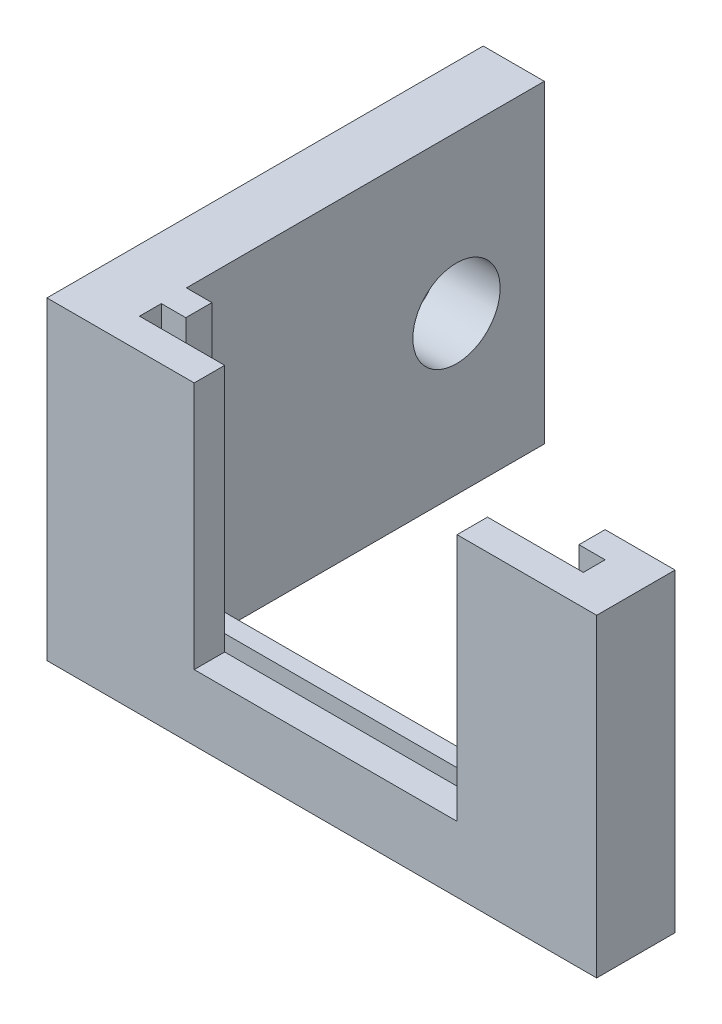
ISO-10303-21;
HEADER;
FILE_DESCRIPTION(('STEP AP214'),'2;1');
FILE_NAME('part.step','',(''),(''),'','','');
FILE_SCHEMA(('AUTOMOTIVE_DESIGN { 1 0 10303 214 1 1 1 1 }'));
ENDSEC;
DATA;
#1=APPLICATION_CONTEXT('core data for automotive mechanical design processes');
#2=APPLICATION_PROTOCOL_DEFINITION('international standard','automotive_design',2000,#1);
#3=PRODUCT_CONTEXT('',#1,'mechanical');
#4=PRODUCT('Part','Part','',(#3));
#5=PRODUCT_RELATED_PRODUCT_CATEGORY('part','',(#4));
#6=PRODUCT_DEFINITION_FORMATION('','',#4);
#7=PRODUCT_DEFINITION_CONTEXT('part definition',#1,'design');
#8=PRODUCT_DEFINITION('design','',#6,#7);
#9=PRODUCT_DEFINITION_SHAPE('','',#8);
#10=(LENGTH_UNIT() NAMED_UNIT(*) SI_UNIT(.MILLI.,.METRE.));
#11=(NAMED_UNIT(*) PLANE_ANGLE_UNIT() SI_UNIT($,.RADIAN.));
#12=(NAMED_UNIT(*) SI_UNIT($,.STERADIAN.) SOLID_ANGLE_UNIT());
#13=UNCERTAINTY_MEASURE_WITH_UNIT(LENGTH_MEASURE(1.E-05),#10,'distance_accuracy_value','');
#14=(GEOMETRIC_REPRESENTATION_CONTEXT(3) GLOBAL_UNCERTAINTY_ASSIGNED_CONTEXT((#13)) GLOBAL_UNIT_ASSIGNED_CONTEXT((#10,
#11,#12)) REPRESENTATION_CONTEXT('',''));
#15=CARTESIAN_POINT('',(0.,0.,0.));
#16=DIRECTION('',(0.,0.,1.));
#17=DIRECTION('',(1.,0.,0.));
#18=AXIS2_PLACEMENT_3D('',#15,#16,#17);
#19=CARTESIAN_POINT('',(0.,18.,25.));
#20=DIRECTION('',(0.,-1.,0.));
#21=DIRECTION('',(0.,0.,-1.));
#22=AXIS2_PLACEMENT_3D('',#19,#20,#21);
#23=PLANE('',#22);
#24=DIRECTION('',(-1.,0.,0.));
#25=VECTOR('',#24,1.);
#26=CARTESIAN_POINT('',(0.,18.,25.));
#27=LINE('',#26,#25);
#28=CARTESIAN_POINT('',(8.43878041398375,18.,25.));
#29=VERTEX_POINT('',#28);
#30=CARTESIAN_POINT('',(0.,18.,25.));
#31=VERTEX_POINT('',#30);
#32=EDGE_CURVE('E201',#29,#31,#27,.T.);
#33=ORIENTED_EDGE('',*,*,#32,.F.);
#34=DIRECTION('',(0.,0.,-1.));
#35=VECTOR('',#34,1.);
#36=CARTESIAN_POINT('',(8.43878041398375,18.,23.2538323637795));
#37=LINE('',#36,#35);
#38=CARTESIAN_POINT('',(8.43878041398375,18.,23.2538323637795));
#39=VERTEX_POINT('',#38);
#40=EDGE_CURVE('E190',#29,#39,#37,.T.);
#41=ORIENTED_EDGE('',*,*,#40,.T.);
#42=DIRECTION('',(1.,0.,0.));
#43=VECTOR('',#42,1.);
#44=CARTESIAN_POINT('',(3.55959575021814,18.,23.2538323637795));
#45=LINE('',#44,#43);
#46=CARTESIAN_POINT('',(3.55959575021814,18.,23.2538323637795));
#47=VERTEX_POINT('',#46);
#48=EDGE_CURVE('E199',#47,#39,#45,.T.);
#49=ORIENTED_EDGE('',*,*,#48,.F.);
#50=DIRECTION('',(0.,0.,1.));
#51=VECTOR('',#50,1.);
#52=CARTESIAN_POINT('',(3.55959575021814,18.,22.0038323637795));
#53=LINE('',#52,#51);
#54=CARTESIAN_POINT('',(3.55959575021814,18.,22.0038323637795));
#55=VERTEX_POINT('',#54);
#56=EDGE_CURVE('E218',#55,#47,#53,.T.);
#57=ORIENTED_EDGE('',*,*,#56,.F.);
#58=DIRECTION('',(-1.,0.,0.));
#59=VECTOR('',#58,1.);
#60=CARTESIAN_POINT('',(4.95959575021814,18.,22.0038323637795));
#61=LINE('',#60,#59);
#62=CARTESIAN_POINT('',(4.95959575021814,18.,22.0038323637795));
#63=VERTEX_POINT('',#62);
#64=EDGE_CURVE('E379',#63,#55,#61,.T.);
#65=ORIENTED_EDGE('',*,*,#64,.F.);
#66=DIRECTION('',(0.,0.,1.));
#67=VECTOR('',#66,1.);
#68=CARTESIAN_POINT('',(4.95959575021813,18.,20.5072345210908));
#69=LINE('',#68,#67);
#70=CARTESIAN_POINT('',(4.95959575021813,18.,20.5072345210908));
#71=VERTEX_POINT('',#70);
#72=EDGE_CURVE('E376',#71,#63,#69,.T.);
#73=ORIENTED_EDGE('',*,*,#72,.F.);
#74=DIRECTION('',(-1.,0.,0.));
#75=VECTOR('',#74,1.);
#76=CARTESIAN_POINT('',(31.5,18.,20.5072345210908));
#77=LINE('',#76,#75);
#78=CARTESIAN_POINT('',(3.5,18.,20.5072345210908));
#79=VERTEX_POINT('',#78);
#80=EDGE_CURVE('E271',#71,#79,#77,.T.);
#81=ORIENTED_EDGE('',*,*,#80,.T.);
#82=DIRECTION('',(0.,0.,-1.));
#83=VECTOR('',#82,1.);
#84=CARTESIAN_POINT('',(3.5,18.,25.));
#85=LINE('',#84,#83);
#86=CARTESIAN_POINT('',(3.5,18.,0.));
#87=VERTEX_POINT('',#86);
#88=EDGE_CURVE('E312',#79,#87,#85,.T.);
#89=ORIENTED_EDGE('',*,*,#88,.T.);
#90=DIRECTION('',(-1.,0.,0.));
#91=VECTOR('',#90,1.);
#92=CARTESIAN_POINT('',(0.,18.,0.));
#93=LINE('',#92,#91);
#94=CARTESIAN_POINT('',(0.,18.,0.));
#95=VERTEX_POINT('',#94);
#96=EDGE_CURVE('E288',#87,#95,#93,.T.);
#97=ORIENTED_EDGE('',*,*,#96,.T.);
#98=DIRECTION('',(0.,0.,-1.));
#99=VECTOR('',#98,1.);
#100=CARTESIAN_POINT('',(0.,18.,25.));
#101=LINE('',#100,#99);
#102=EDGE_CURVE('E295',#31,#95,#101,.T.);
#103=ORIENTED_EDGE('',*,*,#102,.F.);
#104=EDGE_LOOP('',(#33,#41,#49,#57,#65,#73,#81,#89,#97,#103));
#105=FACE_BOUND('',#104,.T.);
#106=ADVANCED_FACE('F39',(#105),#23,.F.);
#107=CARTESIAN_POINT('',(0.,0.,25.));
#108=DIRECTION('',(1.,0.,0.));
#109=DIRECTION('',(0.,0.,-1.));
#110=AXIS2_PLACEMENT_3D('',#107,#108,#109);
#111=PLANE('',#110);
#112=CARTESIAN_POINT('',(0.,9.,5.03071177211722));
#113=DIRECTION('',(1.,0.,0.));
#114=DIRECTION('',(0.,0.,-1.));
#115=AXIS2_PLACEMENT_3D('',#112,#113,#114);
#116=CIRCLE('',#115,2.5);
#117=CARTESIAN_POINT('',(0.,9.,2.53071177211722));
#118=VERTEX_POINT('',#117);
#119=EDGE_CURVE('E716',#118,#118,#116,.T.);
#120=ORIENTED_EDGE('',*,*,#119,.T.);
#121=EDGE_LOOP('',(#120));
#122=FACE_BOUND('',#121,.T.);
#123=DIRECTION('',(0.,-1.,0.));
#124=VECTOR('',#123,1.);
#125=CARTESIAN_POINT('',(0.,0.,0.));
#126=LINE('',#125,#124);
#127=CARTESIAN_POINT('',(0.,0.,0.));
#128=VERTEX_POINT('',#127);
#129=EDGE_CURVE('E282',#95,#128,#126,.T.);
#130=ORIENTED_EDGE('',*,*,#129,.T.);
#131=DIRECTION('',(0.,0.,-1.));
#132=VECTOR('',#131,1.);
#133=CARTESIAN_POINT('',(0.,0.,25.));
#134=LINE('',#133,#132);
#135=CARTESIAN_POINT('',(0.,0.,25.));
#136=VERTEX_POINT('',#135);
#137=EDGE_CURVE('E318',#136,#128,#134,.T.);
#138=ORIENTED_EDGE('',*,*,#137,.F.);
#139=DIRECTION('',(0.,-1.,0.));
#140=VECTOR('',#139,1.);
#141=CARTESIAN_POINT('',(0.,0.,25.));
#142=LINE('',#141,#140);
#143=EDGE_CURVE('E283',#31,#136,#142,.T.);
#144=ORIENTED_EDGE('',*,*,#143,.F.);
#145=ORIENTED_EDGE('',*,*,#102,.T.);
#146=EDGE_LOOP('',(#130,#138,#144,#145));
#147=FACE_BOUND('',#146,.T.);
#148=ADVANCED_FACE('F41',(#122,#147),#111,.F.);
#149=CARTESIAN_POINT('',(0.,0.,25.));
#150=DIRECTION('',(0.,1.,0.));
#151=DIRECTION('',(0.,0.,1.));
#152=AXIS2_PLACEMENT_3D('',#149,#150,#151);
#153=PLANE('',#152);
#154=DIRECTION('',(-1.,0.,0.));
#155=VECTOR('',#154,1.);
#156=CARTESIAN_POINT('',(6.03566998906865,0.,21.5640244765929));
#157=LINE('',#156,#155);
#158=CARTESIAN_POINT('',(24.0356699890686,0.,21.5640244765929));
#159=VERTEX_POINT('',#158);
#160=CARTESIAN_POINT('',(6.03566998906865,0.,21.5640244765929));
#161=VERTEX_POINT('',#160);
#162=EDGE_CURVE('E442',#159,#161,#157,.T.);
#163=ORIENTED_EDGE('',*,*,#162,.T.);
#164=DIRECTION('',(0.,0.,1.));
#165=VECTOR('',#164,1.);
#166=CARTESIAN_POINT('',(6.03566998906865,0.,22.6840244765929));
#167=LINE('',#166,#165);
#168=CARTESIAN_POINT('',(6.03566998906865,0.,22.6840244765929));
#169=VERTEX_POINT('',#168);
#170=EDGE_CURVE('E429',#161,#169,#167,.T.);
#171=ORIENTED_EDGE('',*,*,#170,.T.);
#172=DIRECTION('',(1.,0.,0.));
#173=VECTOR('',#172,1.);
#174=CARTESIAN_POINT('',(6.03566998906865,0.,22.6840244765929));
#175=LINE('',#174,#173);
#176=CARTESIAN_POINT('',(24.0356699890686,0.,22.6840244765929));
#177=VERTEX_POINT('',#176);
#178=EDGE_CURVE('E433',#169,#177,#175,.T.);
#179=ORIENTED_EDGE('',*,*,#178,.T.);
#180=DIRECTION('',(0.,0.,-1.));
#181=VECTOR('',#180,1.);
#182=CARTESIAN_POINT('',(24.0356699890686,0.,22.6840244765929));
#183=LINE('',#182,#181);
#184=EDGE_CURVE('E438',#177,#159,#183,.T.);
#185=ORIENTED_EDGE('',*,*,#184,.T.);
#186=EDGE_LOOP('',(#163,#171,#179,#185));
#187=FACE_BOUND('',#186,.T.);
#188=DIRECTION('',(1.,0.,0.));
#189=VECTOR('',#188,1.);
#190=CARTESIAN_POINT('',(0.,0.,0.));
#191=LINE('',#190,#189);
#192=CARTESIAN_POINT('',(3.5,0.,0.));
#193=VERTEX_POINT('',#192);
#194=EDGE_CURVE('E299',#128,#193,#191,.T.);
#195=ORIENTED_EDGE('',*,*,#194,.T.);
#196=DIRECTION('',(0.,0.,-1.));
#197=VECTOR('',#196,1.);
#198=CARTESIAN_POINT('',(3.5,0.,25.));
#199=LINE('',#198,#197);
#200=CARTESIAN_POINT('',(3.5,0.,20.5072345210908));
#201=VERTEX_POINT('',#200);
#202=EDGE_CURVE('E315',#201,#193,#199,.T.);
#203=ORIENTED_EDGE('',*,*,#202,.F.);
#204=DIRECTION('',(-1.,0.,0.));
#205=VECTOR('',#204,1.);
#206=CARTESIAN_POINT('',(31.5,0.,20.5072345210908));
#207=LINE('',#206,#205);
#208=CARTESIAN_POINT('',(31.5,0.,20.5072345210908));
#209=VERTEX_POINT('',#208);
#210=EDGE_CURVE('E279',#209,#201,#207,.T.);
#211=ORIENTED_EDGE('',*,*,#210,.F.);
#212=DIRECTION('',(0.,0.,-1.));
#213=VECTOR('',#212,1.);
#214=CARTESIAN_POINT('',(31.5,0.,25.));
#215=LINE('',#214,#213);
#216=CARTESIAN_POINT('',(31.5,0.,25.));
#217=VERTEX_POINT('',#216);
#218=EDGE_CURVE('E256',#217,#209,#215,.T.);
#219=ORIENTED_EDGE('',*,*,#218,.F.);
#220=DIRECTION('',(1.,0.,0.));
#221=VECTOR('',#220,1.);
#222=CARTESIAN_POINT('',(0.,0.,25.));
#223=LINE('',#222,#221);
#224=EDGE_CURVE('E287',#136,#217,#223,.T.);
#225=ORIENTED_EDGE('',*,*,#224,.F.);
#226=ORIENTED_EDGE('',*,*,#137,.T.);
#227=EDGE_LOOP('',(#195,#203,#211,#219,#225,#226));
#228=FACE_BOUND('',#227,.T.);
#229=ADVANCED_FACE('F407',(#187,#228),#153,.F.);
#230=CARTESIAN_POINT('',(3.5,0.,25.));
#231=DIRECTION('',(-1.,0.,0.));
#232=DIRECTION('',(0.,0.,1.));
#233=AXIS2_PLACEMENT_3D('',#230,#231,#232);
#234=PLANE('',#233);
#235=CARTESIAN_POINT('',(3.5,9.,5.03071177211722));
#236=DIRECTION('',(-1.,0.,0.));
#237=DIRECTION('',(0.,0.,1.));
#238=AXIS2_PLACEMENT_3D('',#235,#236,#237);
#239=CIRCLE('',#238,2.5);
#240=CARTESIAN_POINT('',(3.5,9.,7.53071177211722));
#241=VERTEX_POINT('',#240);
#242=EDGE_CURVE('E43',#241,#241,#239,.T.);
#243=ORIENTED_EDGE('',*,*,#242,.T.);
#244=EDGE_LOOP('',(#243));
#245=FACE_BOUND('',#244,.T.);
#246=ORIENTED_EDGE('',*,*,#88,.F.);
#247=DIRECTION('',(0.,-1.,0.));
#248=VECTOR('',#247,1.);
#249=CARTESIAN_POINT('',(3.5,18.,20.5072345210908));
#250=LINE('',#249,#248);
#251=EDGE_CURVE('E233',#79,#201,#250,.T.);
#252=ORIENTED_EDGE('',*,*,#251,.T.);
#253=ORIENTED_EDGE('',*,*,#202,.T.);
#254=DIRECTION('',(0.,1.,0.));
#255=VECTOR('',#254,1.);
#256=CARTESIAN_POINT('',(3.5,0.,0.));
#257=LINE('',#256,#255);
#258=EDGE_CURVE('E303',#193,#87,#257,.T.);
#259=ORIENTED_EDGE('',*,*,#258,.T.);
#260=EDGE_LOOP('',(#246,#252,#253,#259));
#261=FACE_BOUND('',#260,.T.);
#262=ADVANCED_FACE('F492',(#245,#261),#234,.F.);
#263=CARTESIAN_POINT('',(23.5,18.,23.2538323637795));
#264=VERTEX_POINT('',#263);
#265=CARTESIAN_POINT('',(28.9895957502181,18.,23.2538323637795));
#266=VERTEX_POINT('',#265);
#267=EDGE_CURVE('E211',#264,#266,#45,.T.);
#268=ORIENTED_EDGE('',*,*,#267,.F.);
#269=DIRECTION('',(0.,0.,1.));
#270=VECTOR('',#269,1.);
#271=CARTESIAN_POINT('',(23.5,18.,23.2538323637795));
#272=LINE('',#271,#270);
#273=CARTESIAN_POINT('',(23.5,18.,25.));
#274=VERTEX_POINT('',#273);
#275=EDGE_CURVE('E203',#264,#274,#272,.T.);
#276=ORIENTED_EDGE('',*,*,#275,.T.);
#277=CARTESIAN_POINT('',(31.5,18.,25.));
#278=VERTEX_POINT('',#277);
#279=EDGE_CURVE('E291',#278,#274,#27,.T.);
#280=ORIENTED_EDGE('',*,*,#279,.F.);
#281=DIRECTION('',(0.,0.,-1.));
#282=VECTOR('',#281,1.);
#283=CARTESIAN_POINT('',(31.5,18.,25.));
#284=LINE('',#283,#282);
#285=CARTESIAN_POINT('',(31.5,18.,20.5072345210908));
#286=VERTEX_POINT('',#285);
#287=EDGE_CURVE('E263',#278,#286,#284,.T.);
#288=ORIENTED_EDGE('',*,*,#287,.T.);
#289=CARTESIAN_POINT('',(27.4895957502181,18.,20.5072345210908));
#290=VERTEX_POINT('',#289);
#291=EDGE_CURVE('E275',#286,#290,#77,.T.);
#292=ORIENTED_EDGE('',*,*,#291,.T.);
#293=DIRECTION('',(0.,0.,-1.));
#294=VECTOR('',#293,1.);
#295=CARTESIAN_POINT('',(27.4895957502181,18.,22.0038323637794));
#296=LINE('',#295,#294);
#297=CARTESIAN_POINT('',(27.4895957502181,18.,22.0038323637794));
#298=VERTEX_POINT('',#297);
#299=EDGE_CURVE('E225',#298,#290,#296,.T.);
#300=ORIENTED_EDGE('',*,*,#299,.F.);
#301=DIRECTION('',(-1.,0.,0.));
#302=VECTOR('',#301,1.);
#303=CARTESIAN_POINT('',(28.9895957502181,18.,22.0038323637795));
#304=LINE('',#303,#302);
#305=CARTESIAN_POINT('',(28.9895957502181,18.,22.0038323637795));
#306=VERTEX_POINT('',#305);
#307=EDGE_CURVE('E216',#306,#298,#304,.T.);
#308=ORIENTED_EDGE('',*,*,#307,.F.);
#309=DIRECTION('',(0.,0.,-1.));
#310=VECTOR('',#309,1.);
#311=CARTESIAN_POINT('',(28.9895957502181,18.,23.2538323637795));
#312=LINE('',#311,#310);
#313=EDGE_CURVE('E210',#266,#306,#312,.T.);
#314=ORIENTED_EDGE('',*,*,#313,.F.);
#315=EDGE_LOOP('',(#268,#276,#280,#288,#292,#300,#308,#314));
#316=FACE_BOUND('',#315,.T.);
#317=ADVANCED_FACE('F337',(#316),#23,.F.);
#318=CARTESIAN_POINT('',(0.,0.,25.));
#319=DIRECTION('',(0.,0.,-1.));
#320=DIRECTION('',(-1.,0.,0.));
#321=AXIS2_PLACEMENT_3D('',#318,#319,#320);
#322=PLANE('',#321);
#323=DIRECTION('',(0.,-1.,0.));
#324=VECTOR('',#323,1.);
#325=CARTESIAN_POINT('',(8.43878041398375,13.4330857353833,25.));
#326=LINE('',#325,#324);
#327=CARTESIAN_POINT('',(8.43878041398375,3.7735342969043,25.));
#328=VERTEX_POINT('',#327);
#329=EDGE_CURVE('E56',#29,#328,#326,.T.);
#330=ORIENTED_EDGE('',*,*,#329,.F.);
#331=ORIENTED_EDGE('',*,*,#32,.T.);
#332=ORIENTED_EDGE('',*,*,#143,.T.);
#333=ORIENTED_EDGE('',*,*,#224,.T.);
#334=DIRECTION('',(0.,-1.,0.));
#335=VECTOR('',#334,1.);
#336=CARTESIAN_POINT('',(31.5,18.,25.));
#337=LINE('',#336,#335);
#338=EDGE_CURVE('E267',#278,#217,#337,.T.);
#339=ORIENTED_EDGE('',*,*,#338,.F.);
#340=ORIENTED_EDGE('',*,*,#279,.T.);
#341=DIRECTION('',(0.,1.,0.));
#342=VECTOR('',#341,1.);
#343=CARTESIAN_POINT('',(23.5,13.4330857353833,25.));
#344=LINE('',#343,#342);
#345=CARTESIAN_POINT('',(23.5,3.7735342969043,25.));
#346=VERTEX_POINT('',#345);
#347=EDGE_CURVE('E332',#346,#274,#344,.T.);
#348=ORIENTED_EDGE('',*,*,#347,.F.);
#349=DIRECTION('',(1.,0.,0.));
#350=VECTOR('',#349,1.);
#351=CARTESIAN_POINT('',(8.43878041398375,3.7735342969043,25.));
#352=LINE('',#351,#350);
#353=EDGE_CURVE('E417',#328,#346,#352,.T.);
#354=ORIENTED_EDGE('',*,*,#353,.F.);
#355=EDGE_LOOP('',(#330,#331,#332,#333,#339,#340,#348,#354));
#356=FACE_BOUND('',#355,.T.);
#357=ADVANCED_FACE('F399',(#356),#322,.F.);
#358=CARTESIAN_POINT('',(0.,0.,0.));
#359=DIRECTION('',(0.,0.,-1.));
#360=DIRECTION('',(-1.,0.,0.));
#361=AXIS2_PLACEMENT_3D('',#358,#359,#360);
#362=PLANE('',#361);
#363=ORIENTED_EDGE('',*,*,#129,.F.);
#364=ORIENTED_EDGE('',*,*,#96,.F.);
#365=ORIENTED_EDGE('',*,*,#258,.F.);
#366=ORIENTED_EDGE('',*,*,#194,.F.);
#367=EDGE_LOOP('',(#363,#364,#365,#366));
#368=FACE_BOUND('',#367,.T.);
#369=ADVANCED_FACE('F497',(#368),#362,.T.);
#370=CARTESIAN_POINT('',(31.5,18.,20.5072345210908));
#371=DIRECTION('',(0.,0.,-1.));
#372=DIRECTION('',(-1.,0.,0.));
#373=AXIS2_PLACEMENT_3D('',#370,#371,#372);
#374=PLANE('',#373);
#375=DIRECTION('',(0.,1.,0.));
#376=VECTOR('',#375,1.);
#377=CARTESIAN_POINT('',(27.4895957502181,3.,20.5072345210908));
#378=LINE('',#377,#376);
#379=CARTESIAN_POINT('',(27.4895957502181,3.,20.5072345210908));
#380=VERTEX_POINT('',#379);
#381=EDGE_CURVE('E229',#380,#290,#378,.T.);
#382=ORIENTED_EDGE('',*,*,#381,.T.);
#383=ORIENTED_EDGE('',*,*,#291,.F.);
#384=DIRECTION('',(0.,-1.,0.));
#385=VECTOR('',#384,1.);
#386=CARTESIAN_POINT('',(31.5,18.,20.5072345210908));
#387=LINE('',#386,#385);
#388=EDGE_CURVE('E259',#286,#209,#387,.T.);
#389=ORIENTED_EDGE('',*,*,#388,.T.);
#390=ORIENTED_EDGE('',*,*,#210,.T.);
#391=ORIENTED_EDGE('',*,*,#251,.F.);
#392=ORIENTED_EDGE('',*,*,#80,.F.);
#393=DIRECTION('',(0.,1.,0.));
#394=VECTOR('',#393,1.);
#395=CARTESIAN_POINT('',(4.95959575021813,3.,20.5072345210908));
#396=LINE('',#395,#394);
#397=CARTESIAN_POINT('',(4.95959575021813,3.,20.5072345210908));
#398=VERTEX_POINT('',#397);
#399=EDGE_CURVE('E252',#398,#71,#396,.T.);
#400=ORIENTED_EDGE('',*,*,#399,.F.);
#401=DIRECTION('',(-1.,0.,0.));
#402=VECTOR('',#401,1.);
#403=CARTESIAN_POINT('',(27.4895957502181,3.,20.5072345210908));
#404=LINE('',#403,#402);
#405=EDGE_CURVE('E228',#380,#398,#404,.T.);
#406=ORIENTED_EDGE('',*,*,#405,.F.);
#407=EDGE_LOOP('',(#382,#383,#389,#390,#391,#392,#400,#406));
#408=FACE_BOUND('',#407,.T.);
#409=ADVANCED_FACE('F393',(#408),#374,.T.);
#410=CARTESIAN_POINT('',(31.5,0.,0.));
#411=DIRECTION('',(-1.,0.,0.));
#412=DIRECTION('',(0.,0.,1.));
#413=AXIS2_PLACEMENT_3D('',#410,#411,#412);
#414=PLANE('',#413);
#415=ORIENTED_EDGE('',*,*,#218,.T.);
#416=ORIENTED_EDGE('',*,*,#388,.F.);
#417=ORIENTED_EDGE('',*,*,#287,.F.);
#418=ORIENTED_EDGE('',*,*,#338,.T.);
#419=EDGE_LOOP('',(#415,#416,#417,#418));
#420=FACE_BOUND('',#419,.T.);
#421=ADVANCED_FACE('F415',(#420),#414,.F.);
#422=CARTESIAN_POINT('',(27.4895957502181,3.,22.0038323637794));
#423=DIRECTION('',(1.,0.,0.));
#424=DIRECTION('',(0.,0.,-1.));
#425=AXIS2_PLACEMENT_3D('',#422,#423,#424);
#426=PLANE('',#425);
#427=ORIENTED_EDGE('',*,*,#299,.T.);
#428=ORIENTED_EDGE('',*,*,#381,.F.);
#429=DIRECTION('',(0.,0.,-1.));
#430=VECTOR('',#429,1.);
#431=CARTESIAN_POINT('',(27.4895957502181,3.,22.0038323637794));
#432=LINE('',#431,#430);
#433=CARTESIAN_POINT('',(27.4895957502181,3.,22.0038323637794));
#434=VERTEX_POINT('',#433);
#435=EDGE_CURVE('E255',#434,#380,#432,.T.);
#436=ORIENTED_EDGE('',*,*,#435,.F.);
#437=DIRECTION('',(0.,1.,0.));
#438=VECTOR('',#437,1.);
#439=CARTESIAN_POINT('',(27.4895957502181,3.,22.0038323637794));
#440=LINE('',#439,#438);
#441=EDGE_CURVE('E234',#434,#298,#440,.T.);
#442=ORIENTED_EDGE('',*,*,#441,.T.);
#443=EDGE_LOOP('',(#427,#428,#436,#442));
#444=FACE_BOUND('',#443,.T.);
#445=ADVANCED_FACE('F515',(#444),#426,.F.);
#446=CARTESIAN_POINT('',(28.9895957502181,3.,22.0038323637795));
#447=DIRECTION('',(0.,0.,-1.));
#448=DIRECTION('',(-1.,0.,0.));
#449=AXIS2_PLACEMENT_3D('',#446,#447,#448);
#450=PLANE('',#449);
#451=ORIENTED_EDGE('',*,*,#307,.T.);
#452=ORIENTED_EDGE('',*,*,#441,.F.);
#453=DIRECTION('',(-1.,0.,0.));
#454=VECTOR('',#453,1.);
#455=CARTESIAN_POINT('',(28.9895957502181,3.,22.0038323637795));
#456=LINE('',#455,#454);
#457=CARTESIAN_POINT('',(28.9895957502181,3.,22.0038323637795));
#458=VERTEX_POINT('',#457);
#459=EDGE_CURVE('E370',#458,#434,#456,.T.);
#460=ORIENTED_EDGE('',*,*,#459,.F.);
#461=DIRECTION('',(0.,1.,0.));
#462=VECTOR('',#461,1.);
#463=CARTESIAN_POINT('',(28.9895957502181,3.,22.0038323637795));
#464=LINE('',#463,#462);
#465=EDGE_CURVE('E237',#458,#306,#464,.T.);
#466=ORIENTED_EDGE('',*,*,#465,.T.);
#467=EDGE_LOOP('',(#451,#452,#460,#466));
#468=FACE_BOUND('',#467,.T.);
#469=ADVANCED_FACE('F519',(#468),#450,.F.);
#470=CARTESIAN_POINT('',(28.9895957502181,3.,23.2538323637795));
#471=DIRECTION('',(1.,0.,0.));
#472=DIRECTION('',(0.,0.,-1.));
#473=AXIS2_PLACEMENT_3D('',#470,#471,#472);
#474=PLANE('',#473);
#475=ORIENTED_EDGE('',*,*,#313,.T.);
#476=ORIENTED_EDGE('',*,*,#465,.F.);
#477=DIRECTION('',(0.,0.,-1.));
#478=VECTOR('',#477,1.);
#479=CARTESIAN_POINT('',(28.9895957502181,3.,23.2538323637795));
#480=LINE('',#479,#478);
#481=CARTESIAN_POINT('',(28.9895957502181,3.,23.2538323637795));
#482=VERTEX_POINT('',#481);
#483=EDGE_CURVE('E345',#482,#458,#480,.T.);
#484=ORIENTED_EDGE('',*,*,#483,.F.);
#485=DIRECTION('',(0.,1.,0.));
#486=VECTOR('',#485,1.);
#487=CARTESIAN_POINT('',(28.9895957502181,3.,23.2538323637795));
#488=LINE('',#487,#486);
#489=EDGE_CURVE('E240',#482,#266,#488,.T.);
#490=ORIENTED_EDGE('',*,*,#489,.T.);
#491=EDGE_LOOP('',(#475,#476,#484,#490));
#492=FACE_BOUND('',#491,.T.);
#493=ADVANCED_FACE('F341',(#492),#474,.F.);
#494=CARTESIAN_POINT('',(3.55959575021814,3.,23.2538323637795));
#495=DIRECTION('',(0.,0.,1.));
#496=DIRECTION('',(1.,0.,0.));
#497=AXIS2_PLACEMENT_3D('',#494,#495,#496);
#498=PLANE('',#497);
#499=ORIENTED_EDGE('',*,*,#48,.T.);
#500=DIRECTION('',(0.,-1.,0.));
#501=VECTOR('',#500,1.);
#502=CARTESIAN_POINT('',(8.43878041398375,3.,23.2538323637795));
#503=LINE('',#502,#501);
#504=CARTESIAN_POINT('',(8.43878041398375,3.7735342969043,23.2538323637795));
#505=VERTEX_POINT('',#504);
#506=EDGE_CURVE('E11',#39,#505,#503,.T.);
#507=ORIENTED_EDGE('',*,*,#506,.T.);
#508=DIRECTION('',(1.,0.,0.));
#509=VECTOR('',#508,1.);
#510=CARTESIAN_POINT('',(3.55959575021814,3.7735342969043,23.2538323637795));
#511=LINE('',#510,#509);
#512=CARTESIAN_POINT('',(23.5,3.7735342969043,23.2538323637795));
#513=VERTEX_POINT('',#512);
#514=EDGE_CURVE('E322',#505,#513,#511,.T.);
#515=ORIENTED_EDGE('',*,*,#514,.T.);
#516=DIRECTION('',(0.,1.,0.));
#517=VECTOR('',#516,1.);
#518=CARTESIAN_POINT('',(23.5,3.,23.2538323637795));
#519=LINE('',#518,#517);
#520=EDGE_CURVE('E49',#513,#264,#519,.T.);
#521=ORIENTED_EDGE('',*,*,#520,.T.);
#522=ORIENTED_EDGE('',*,*,#267,.T.);
#523=ORIENTED_EDGE('',*,*,#489,.F.);
#524=DIRECTION('',(1.,0.,0.));
#525=VECTOR('',#524,1.);
#526=CARTESIAN_POINT('',(3.55959575021814,3.,23.2538323637795));
#527=LINE('',#526,#525);
#528=CARTESIAN_POINT('',(3.55959575021814,3.,23.2538323637795));
#529=VERTEX_POINT('',#528);
#530=EDGE_CURVE('E347',#529,#482,#527,.T.);
#531=ORIENTED_EDGE('',*,*,#530,.F.);
#532=DIRECTION('',(0.,1.,0.));
#533=VECTOR('',#532,1.);
#534=CARTESIAN_POINT('',(3.55959575021814,3.,23.2538323637795));
#535=LINE('',#534,#533);
#536=EDGE_CURVE('E207',#529,#47,#535,.T.);
#537=ORIENTED_EDGE('',*,*,#536,.T.);
#538=EDGE_LOOP('',(#499,#507,#515,#521,#522,#523,#531,#537));
#539=FACE_BOUND('',#538,.T.);
#540=ADVANCED_FACE('F205',(#539),#498,.F.);
#541=CARTESIAN_POINT('',(3.55959575021814,3.,22.0038323637795));
#542=DIRECTION('',(-1.,0.,0.));
#543=DIRECTION('',(0.,0.,1.));
#544=AXIS2_PLACEMENT_3D('',#541,#542,#543);
#545=PLANE('',#544);
#546=ORIENTED_EDGE('',*,*,#56,.T.);
#547=ORIENTED_EDGE('',*,*,#536,.F.);
#548=DIRECTION('',(0.,0.,1.));
#549=VECTOR('',#548,1.);
#550=CARTESIAN_POINT('',(3.55959575021814,3.,22.0038323637795));
#551=LINE('',#550,#549);
#552=CARTESIAN_POINT('',(3.55959575021814,3.,22.0038323637795));
#553=VERTEX_POINT('',#552);
#554=EDGE_CURVE('E351',#553,#529,#551,.T.);
#555=ORIENTED_EDGE('',*,*,#554,.F.);
#556=DIRECTION('',(0.,1.,0.));
#557=VECTOR('',#556,1.);
#558=CARTESIAN_POINT('',(3.55959575021814,3.,22.0038323637795));
#559=LINE('',#558,#557);
#560=EDGE_CURVE('E246',#553,#55,#559,.T.);
#561=ORIENTED_EDGE('',*,*,#560,.T.);
#562=EDGE_LOOP('',(#546,#547,#555,#561));
#563=FACE_BOUND('',#562,.T.);
#564=ADVANCED_FACE('F386',(#563),#545,.F.);
#565=CARTESIAN_POINT('',(4.95959575021814,3.,22.0038323637795));
#566=DIRECTION('',(0.,0.,-1.));
#567=DIRECTION('',(-1.,0.,0.));
#568=AXIS2_PLACEMENT_3D('',#565,#566,#567);
#569=PLANE('',#568);
#570=ORIENTED_EDGE('',*,*,#64,.T.);
#571=ORIENTED_EDGE('',*,*,#560,.F.);
#572=DIRECTION('',(-1.,0.,0.));
#573=VECTOR('',#572,1.);
#574=CARTESIAN_POINT('',(4.95959575021814,3.,22.0038323637795));
#575=LINE('',#574,#573);
#576=CARTESIAN_POINT('',(4.95959575021814,3.,22.0038323637795));
#577=VERTEX_POINT('',#576);
#578=EDGE_CURVE('E359',#577,#553,#575,.T.);
#579=ORIENTED_EDGE('',*,*,#578,.F.);
#580=DIRECTION('',(0.,1.,0.));
#581=VECTOR('',#580,1.);
#582=CARTESIAN_POINT('',(4.95959575021814,3.,22.0038323637795));
#583=LINE('',#582,#581);
#584=EDGE_CURVE('E249',#577,#63,#583,.T.);
#585=ORIENTED_EDGE('',*,*,#584,.T.);
#586=EDGE_LOOP('',(#570,#571,#579,#585));
#587=FACE_BOUND('',#586,.T.);
#588=ADVANCED_FACE('F474',(#587),#569,.F.);
#589=CARTESIAN_POINT('',(4.95959575021813,3.,20.5072345210908));
#590=DIRECTION('',(-1.,0.,0.));
#591=DIRECTION('',(0.,0.,1.));
#592=AXIS2_PLACEMENT_3D('',#589,#590,#591);
#593=PLANE('',#592);
#594=ORIENTED_EDGE('',*,*,#72,.T.);
#595=ORIENTED_EDGE('',*,*,#584,.F.);
#596=DIRECTION('',(0.,0.,1.));
#597=VECTOR('',#596,1.);
#598=CARTESIAN_POINT('',(4.95959575021813,3.,20.5072345210908));
#599=LINE('',#598,#597);
#600=EDGE_CURVE('E364',#398,#577,#599,.T.);
#601=ORIENTED_EDGE('',*,*,#600,.F.);
#602=ORIENTED_EDGE('',*,*,#399,.T.);
#603=EDGE_LOOP('',(#594,#595,#601,#602));
#604=FACE_BOUND('',#603,.T.);
#605=ADVANCED_FACE('F473',(#604),#593,.F.);
#606=CARTESIAN_POINT('',(0.,3.,0.));
#607=DIRECTION('',(0.,1.,0.));
#608=DIRECTION('',(0.,0.,1.));
#609=AXIS2_PLACEMENT_3D('',#606,#607,#608);
#610=PLANE('',#609);
#611=DIRECTION('',(0.,0.,1.));
#612=VECTOR('',#611,1.);
#613=CARTESIAN_POINT('',(6.03566998906865,3.,22.6840244765929));
#614=LINE('',#613,#612);
#615=CARTESIAN_POINT('',(6.03566998906865,3.,21.5640244765929));
#616=VERTEX_POINT('',#615);
#617=CARTESIAN_POINT('',(6.03566998906865,3.,22.6840244765929));
#618=VERTEX_POINT('',#617);
#619=EDGE_CURVE('E427',#616,#618,#614,.T.);
#620=ORIENTED_EDGE('',*,*,#619,.F.);
#621=DIRECTION('',(-1.,0.,0.));
#622=VECTOR('',#621,1.);
#623=CARTESIAN_POINT('',(6.03566998906865,3.,21.5640244765929));
#624=LINE('',#623,#622);
#625=CARTESIAN_POINT('',(24.0356699890686,3.,21.5640244765929));
#626=VERTEX_POINT('',#625);
#627=EDGE_CURVE('E434',#626,#616,#624,.T.);
#628=ORIENTED_EDGE('',*,*,#627,.F.);
#629=DIRECTION('',(0.,0.,-1.));
#630=VECTOR('',#629,1.);
#631=CARTESIAN_POINT('',(24.0356699890686,3.,22.6840244765929));
#632=LINE('',#631,#630);
#633=CARTESIAN_POINT('',(24.0356699890686,3.,22.6840244765929));
#634=VERTEX_POINT('',#633);
#635=EDGE_CURVE('E453',#634,#626,#632,.T.);
#636=ORIENTED_EDGE('',*,*,#635,.F.);
#637=DIRECTION('',(1.,0.,0.));
#638=VECTOR('',#637,1.);
#639=CARTESIAN_POINT('',(6.03566998906865,3.,22.6840244765929));
#640=LINE('',#639,#638);
#641=EDGE_CURVE('E449',#618,#634,#640,.T.);
#642=ORIENTED_EDGE('',*,*,#641,.F.);
#643=EDGE_LOOP('',(#620,#628,#636,#642));
#644=FACE_BOUND('',#643,.T.);
#645=ORIENTED_EDGE('',*,*,#405,.T.);
#646=ORIENTED_EDGE('',*,*,#600,.T.);
#647=ORIENTED_EDGE('',*,*,#578,.T.);
#648=ORIENTED_EDGE('',*,*,#554,.T.);
#649=ORIENTED_EDGE('',*,*,#530,.T.);
#650=ORIENTED_EDGE('',*,*,#483,.T.);
#651=ORIENTED_EDGE('',*,*,#459,.T.);
#652=ORIENTED_EDGE('',*,*,#435,.T.);
#653=EDGE_LOOP('',(#645,#646,#647,#648,#649,#650,#651,#652));
#654=FACE_BOUND('',#653,.T.);
#655=ADVANCED_FACE('F356',(#644,#654),#610,.T.);
#656=CARTESIAN_POINT('',(6.03566998906865,0.,22.6840244765929));
#657=DIRECTION('',(-1.,0.,0.));
#658=DIRECTION('',(0.,0.,1.));
#659=AXIS2_PLACEMENT_3D('',#656,#657,#658);
#660=PLANE('',#659);
#661=ORIENTED_EDGE('',*,*,#619,.T.);
#662=DIRECTION('',(0.,1.,0.));
#663=VECTOR('',#662,1.);
#664=CARTESIAN_POINT('',(6.03566998906865,0.,22.6840244765929));
#665=LINE('',#664,#663);
#666=EDGE_CURVE('E446',#169,#618,#665,.T.);
#667=ORIENTED_EDGE('',*,*,#666,.F.);
#668=ORIENTED_EDGE('',*,*,#170,.F.);
#669=DIRECTION('',(0.,1.,0.));
#670=VECTOR('',#669,1.);
#671=CARTESIAN_POINT('',(6.03566998906865,0.,21.5640244765929));
#672=LINE('',#671,#670);
#673=EDGE_CURVE('E380',#161,#616,#672,.T.);
#674=ORIENTED_EDGE('',*,*,#673,.T.);
#675=EDGE_LOOP('',(#661,#667,#668,#674));
#676=FACE_BOUND('',#675,.T.);
#677=ADVANCED_FACE('F574',(#676),#660,.F.);
#678=CARTESIAN_POINT('',(6.03566998906865,0.,21.5640244765929));
#679=DIRECTION('',(0.,0.,-1.));
#680=DIRECTION('',(-1.,0.,0.));
#681=AXIS2_PLACEMENT_3D('',#678,#679,#680);
#682=PLANE('',#681);
#683=ORIENTED_EDGE('',*,*,#627,.T.);
#684=ORIENTED_EDGE('',*,*,#673,.F.);
#685=ORIENTED_EDGE('',*,*,#162,.F.);
#686=DIRECTION('',(0.,1.,0.));
#687=VECTOR('',#686,1.);
#688=CARTESIAN_POINT('',(24.0356699890686,0.,21.5640244765929));
#689=LINE('',#688,#687);
#690=EDGE_CURVE('E462',#159,#626,#689,.T.);
#691=ORIENTED_EDGE('',*,*,#690,.T.);
#692=EDGE_LOOP('',(#683,#684,#685,#691));
#693=FACE_BOUND('',#692,.T.);
#694=ADVANCED_FACE('F583',(#693),#682,.F.);
#695=CARTESIAN_POINT('',(24.0356699890686,0.,22.6840244765929));
#696=DIRECTION('',(1.,0.,0.));
#697=DIRECTION('',(0.,0.,-1.));
#698=AXIS2_PLACEMENT_3D('',#695,#696,#697);
#699=PLANE('',#698);
#700=ORIENTED_EDGE('',*,*,#635,.T.);
#701=ORIENTED_EDGE('',*,*,#690,.F.);
#702=ORIENTED_EDGE('',*,*,#184,.F.);
#703=DIRECTION('',(0.,1.,0.));
#704=VECTOR('',#703,1.);
#705=CARTESIAN_POINT('',(24.0356699890686,0.,22.6840244765929));
#706=LINE('',#705,#704);
#707=EDGE_CURVE('E465',#177,#634,#706,.T.);
#708=ORIENTED_EDGE('',*,*,#707,.T.);
#709=EDGE_LOOP('',(#700,#701,#702,#708));
#710=FACE_BOUND('',#709,.T.);
#711=ADVANCED_FACE('F592',(#710),#699,.F.);
#712=CARTESIAN_POINT('',(6.03566998906865,0.,22.6840244765929));
#713=DIRECTION('',(0.,0.,1.));
#714=DIRECTION('',(1.,0.,0.));
#715=AXIS2_PLACEMENT_3D('',#712,#713,#714);
#716=PLANE('',#715);
#717=ORIENTED_EDGE('',*,*,#641,.T.);
#718=ORIENTED_EDGE('',*,*,#707,.F.);
#719=ORIENTED_EDGE('',*,*,#178,.F.);
#720=ORIENTED_EDGE('',*,*,#666,.T.);
#721=EDGE_LOOP('',(#717,#718,#719,#720));
#722=FACE_BOUND('',#721,.T.);
#723=ADVANCED_FACE('F602',(#722),#716,.F.);
#724=CARTESIAN_POINT('',(8.43878041398375,13.4330857353833,0.));
#725=DIRECTION('',(-1.,0.,0.));
#726=DIRECTION('',(0.,0.,1.));
#727=AXIS2_PLACEMENT_3D('',#724,#725,#726);
#728=PLANE('',#727);
#729=ORIENTED_EDGE('',*,*,#506,.F.);
#730=ORIENTED_EDGE('',*,*,#40,.F.);
#731=ORIENTED_EDGE('',*,*,#329,.T.);
#732=DIRECTION('',(0.,0.,1.));
#733=VECTOR('',#732,1.);
#734=CARTESIAN_POINT('',(8.43878041398375,3.7735342969043,0.));
#735=LINE('',#734,#733);
#736=EDGE_CURVE('E192',#505,#328,#735,.T.);
#737=ORIENTED_EDGE('',*,*,#736,.F.);
#738=EDGE_LOOP('',(#729,#730,#731,#737));
#739=FACE_BOUND('',#738,.T.);
#740=ADVANCED_FACE('F189',(#739),#728,.F.);
#741=CARTESIAN_POINT('',(23.5,13.4330857353833,0.));
#742=DIRECTION('',(1.,0.,0.));
#743=DIRECTION('',(0.,0.,-1.));
#744=AXIS2_PLACEMENT_3D('',#741,#742,#743);
#745=PLANE('',#744);
#746=DIRECTION('',(0.,0.,1.));
#747=VECTOR('',#746,1.);
#748=CARTESIAN_POINT('',(23.5,3.7735342969043,0.));
#749=LINE('',#748,#747);
#750=EDGE_CURVE('E64',#513,#346,#749,.T.);
#751=ORIENTED_EDGE('',*,*,#750,.T.);
#752=ORIENTED_EDGE('',*,*,#347,.T.);
#753=ORIENTED_EDGE('',*,*,#275,.F.);
#754=ORIENTED_EDGE('',*,*,#520,.F.);
#755=EDGE_LOOP('',(#751,#752,#753,#754));
#756=FACE_BOUND('',#755,.T.);
#757=ADVANCED_FACE('F330',(#756),#745,.F.);
#758=CARTESIAN_POINT('',(8.43878041398375,3.7735342969043,0.));
#759=DIRECTION('',(0.,-1.,0.));
#760=DIRECTION('',(0.,0.,-1.));
#761=AXIS2_PLACEMENT_3D('',#758,#759,#760);
#762=PLANE('',#761);
#763=ORIENTED_EDGE('',*,*,#736,.T.);
#764=ORIENTED_EDGE('',*,*,#353,.T.);
#765=ORIENTED_EDGE('',*,*,#750,.F.);
#766=ORIENTED_EDGE('',*,*,#514,.F.);
#767=EDGE_LOOP('',(#763,#764,#765,#766));
#768=FACE_BOUND('',#767,.T.);
#769=ADVANCED_FACE('F619',(#768),#762,.F.);
#770=CARTESIAN_POINT('',(31.5,9.,5.03071177211722));
#771=DIRECTION('',(-1.,0.,0.));
#772=DIRECTION('',(0.,0.,1.));
#773=AXIS2_PLACEMENT_3D('',#770,#771,#772);
#774=CYLINDRICAL_SURFACE('',#773,2.5);
#775=ORIENTED_EDGE('',*,*,#242,.F.);
#776=EDGE_LOOP('',(#775));
#777=FACE_BOUND('',#776,.T.);
#778=ORIENTED_EDGE('',*,*,#119,.F.);
#779=EDGE_LOOP('',(#778));
#780=FACE_BOUND('',#779,.T.);
#781=ADVANCED_FACE('F624',(#777,#780),#774,.F.);
#782=CLOSED_SHELL('',(#106,#148,#229,#262,#317,#357,#369,#409,#421,#445,#469,#493,#540,#564,
#588,#605,#655,#677,#694,#711,#723,#740,#757,#769,#781));
#783=MANIFOLD_SOLID_BREP('B2',#782);
#784=ADVANCED_BREP_SHAPE_REPRESENTATION('',(#18,#783),#14);
#785=SHAPE_DEFINITION_REPRESENTATION(#9,#784);
ENDSEC;
END-ISO-10303-21;
